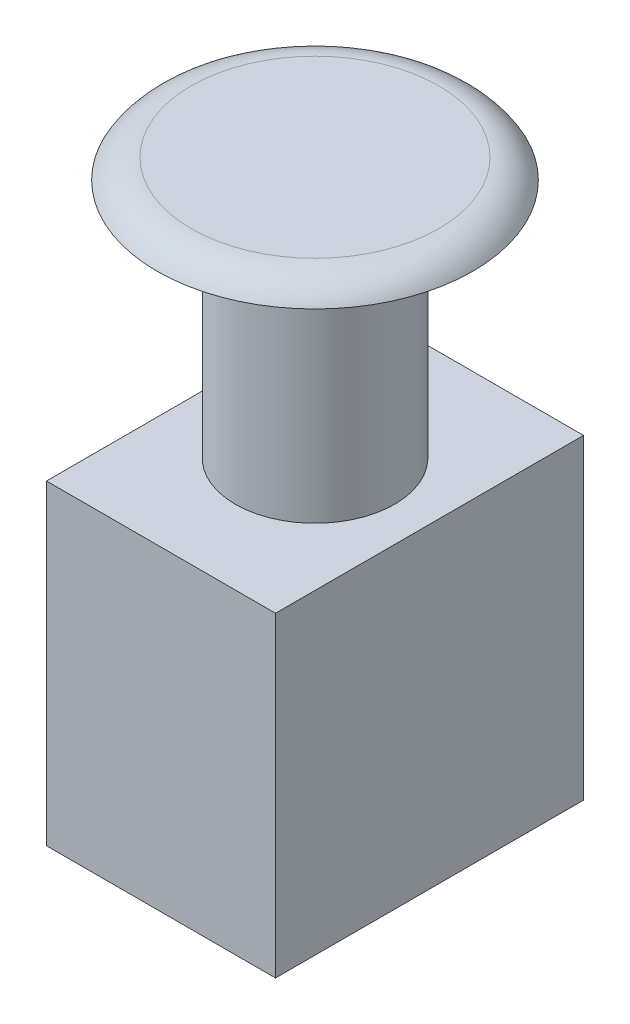
ISO-10303-21;
HEADER;
FILE_DESCRIPTION(('STEP AP214'),'2;1');
FILE_NAME('part.step','',(''),(''),'','','');
FILE_SCHEMA(('AUTOMOTIVE_DESIGN { 1 0 10303 214 1 1 1 1 }'));
ENDSEC;
DATA;
#1=APPLICATION_CONTEXT('core data for automotive mechanical design processes');
#2=APPLICATION_PROTOCOL_DEFINITION('international standard','automotive_design',2000,#1);
#3=PRODUCT_CONTEXT('',#1,'mechanical');
#4=PRODUCT('Part','Part','',(#3));
#5=PRODUCT_RELATED_PRODUCT_CATEGORY('part','',(#4));
#6=PRODUCT_DEFINITION_FORMATION('','',#4);
#7=PRODUCT_DEFINITION_CONTEXT('part definition',#1,'design');
#8=PRODUCT_DEFINITION('design','',#6,#7);
#9=PRODUCT_DEFINITION_SHAPE('','',#8);
#10=(LENGTH_UNIT() NAMED_UNIT(*) SI_UNIT(.MILLI.,.METRE.));
#11=(NAMED_UNIT(*) PLANE_ANGLE_UNIT() SI_UNIT($,.RADIAN.));
#12=(NAMED_UNIT(*) SI_UNIT($,.STERADIAN.) SOLID_ANGLE_UNIT());
#13=UNCERTAINTY_MEASURE_WITH_UNIT(LENGTH_MEASURE(1.E-05),#10,'distance_accuracy_value','');
#14=(GEOMETRIC_REPRESENTATION_CONTEXT(3) GLOBAL_UNCERTAINTY_ASSIGNED_CONTEXT((#13)) GLOBAL_UNIT_ASSIGNED_CONTEXT((#10,
#11,#12)) REPRESENTATION_CONTEXT('',''));
#15=CARTESIAN_POINT('',(0.,0.,0.));
#16=DIRECTION('',(0.,0.,1.));
#17=DIRECTION('',(1.,0.,0.));
#18=AXIS2_PLACEMENT_3D('',#15,#16,#17);
#19=CARTESIAN_POINT('',(0.,73.,0.));
#20=DIRECTION('',(0.,-1.,0.));
#21=DIRECTION('',(0.,0.,-1.));
#22=AXIS2_PLACEMENT_3D('',#19,#20,#21);
#23=CYLINDRICAL_SURFACE('',#22,10.1);
#24=CARTESIAN_POINT('',(0.,40.,0.));
#25=DIRECTION('',(0.,1.,0.));
#26=DIRECTION('',(0.,0.,1.));
#27=AXIS2_PLACEMENT_3D('',#24,#25,#26);
#28=CIRCLE('',#27,10.1);
#29=CARTESIAN_POINT('',(0.,40.,10.1));
#30=VERTEX_POINT('',#29);
#31=EDGE_CURVE('E131',#30,#30,#28,.T.);
#32=ORIENTED_EDGE('',*,*,#31,.T.);
#33=EDGE_LOOP('',(#32));
#34=FACE_BOUND('',#33,.T.);
#35=CARTESIAN_POINT('',(0.,70.5,0.));
#36=DIRECTION('',(0.,1.,0.));
#37=DIRECTION('',(0.,0.,1.));
#38=AXIS2_PLACEMENT_3D('',#35,#36,#37);
#39=CIRCLE('',#38,10.1);
#40=CARTESIAN_POINT('',(0.,70.5,10.1));
#41=VERTEX_POINT('',#40);
#42=EDGE_CURVE('E51',#41,#41,#39,.T.);
#43=ORIENTED_EDGE('',*,*,#42,.F.);
#44=EDGE_LOOP('',(#43));
#45=FACE_BOUND('',#44,.T.);
#46=ADVANCED_FACE('F41',(#34,#45),#23,.T.);
#47=CARTESIAN_POINT('',(-14.5,40.,-19.5));
#48=DIRECTION('',(0.,0.,-1.));
#49=DIRECTION('',(-1.,0.,0.));
#50=AXIS2_PLACEMENT_3D('',#47,#48,#49);
#51=PLANE('',#50);
#52=DIRECTION('',(1.,0.,0.));
#53=VECTOR('',#52,1.);
#54=CARTESIAN_POINT('',(-14.5,0.,-19.5));
#55=LINE('',#54,#53);
#56=CARTESIAN_POINT('',(-14.5,0.,-19.5));
#57=VERTEX_POINT('',#56);
#58=CARTESIAN_POINT('',(14.5,0.,-19.5));
#59=VERTEX_POINT('',#58);
#60=EDGE_CURVE('E117',#57,#59,#55,.T.);
#61=ORIENTED_EDGE('',*,*,#60,.F.);
#62=DIRECTION('',(0.,-1.,0.));
#63=VECTOR('',#62,1.);
#64=CARTESIAN_POINT('',(-14.5,40.,-19.5));
#65=LINE('',#64,#63);
#66=CARTESIAN_POINT('',(-14.5,40.,-19.5));
#67=VERTEX_POINT('',#66);
#68=EDGE_CURVE('E59',#67,#57,#65,.T.);
#69=ORIENTED_EDGE('',*,*,#68,.F.);
#70=DIRECTION('',(1.,0.,0.));
#71=VECTOR('',#70,1.);
#72=CARTESIAN_POINT('',(-14.5,40.,-19.5));
#73=LINE('',#72,#71);
#74=CARTESIAN_POINT('',(14.5,40.,-19.5));
#75=VERTEX_POINT('',#74);
#76=EDGE_CURVE('E109',#67,#75,#73,.T.);
#77=ORIENTED_EDGE('',*,*,#76,.T.);
#78=DIRECTION('',(0.,-1.,0.));
#79=VECTOR('',#78,1.);
#80=CARTESIAN_POINT('',(14.5,40.,-19.5));
#81=LINE('',#80,#79);
#82=EDGE_CURVE('E84',#75,#59,#81,.T.);
#83=ORIENTED_EDGE('',*,*,#82,.T.);
#84=EDGE_LOOP('',(#61,#69,#77,#83));
#85=FACE_BOUND('',#84,.T.);
#86=ADVANCED_FACE('F164',(#85),#51,.T.);
#87=CARTESIAN_POINT('',(-14.5,40.,-19.5));
#88=DIRECTION('',(1.,0.,0.));
#89=DIRECTION('',(0.,0.,-1.));
#90=AXIS2_PLACEMENT_3D('',#87,#88,#89);
#91=PLANE('',#90);
#92=DIRECTION('',(0.,0.,1.));
#93=VECTOR('',#92,1.);
#94=CARTESIAN_POINT('',(-14.5,0.,-19.5));
#95=LINE('',#94,#93);
#96=CARTESIAN_POINT('',(-14.5,0.,19.5));
#97=VERTEX_POINT('',#96);
#98=EDGE_CURVE('E76',#57,#97,#95,.T.);
#99=ORIENTED_EDGE('',*,*,#98,.T.);
#100=DIRECTION('',(0.,-1.,0.));
#101=VECTOR('',#100,1.);
#102=CARTESIAN_POINT('',(-14.5,40.,19.5));
#103=LINE('',#102,#101);
#104=CARTESIAN_POINT('',(-14.5,40.,19.5));
#105=VERTEX_POINT('',#104);
#106=EDGE_CURVE('E105',#105,#97,#103,.T.);
#107=ORIENTED_EDGE('',*,*,#106,.F.);
#108=DIRECTION('',(0.,0.,1.));
#109=VECTOR('',#108,1.);
#110=CARTESIAN_POINT('',(-14.5,40.,-19.5));
#111=LINE('',#110,#109);
#112=EDGE_CURVE('E94',#67,#105,#111,.T.);
#113=ORIENTED_EDGE('',*,*,#112,.F.);
#114=ORIENTED_EDGE('',*,*,#68,.T.);
#115=EDGE_LOOP('',(#99,#107,#113,#114));
#116=FACE_BOUND('',#115,.T.);
#117=ADVANCED_FACE('F169',(#116),#91,.F.);
#118=CARTESIAN_POINT('',(-14.5,40.,19.5));
#119=DIRECTION('',(0.,0.,-1.));
#120=DIRECTION('',(-1.,0.,0.));
#121=AXIS2_PLACEMENT_3D('',#118,#119,#120);
#122=PLANE('',#121);
#123=DIRECTION('',(1.,0.,0.));
#124=VECTOR('',#123,1.);
#125=CARTESIAN_POINT('',(-14.5,0.,19.5));
#126=LINE('',#125,#124);
#127=CARTESIAN_POINT('',(14.5,0.,19.5));
#128=VERTEX_POINT('',#127);
#129=EDGE_CURVE('E102',#97,#128,#126,.T.);
#130=ORIENTED_EDGE('',*,*,#129,.T.);
#131=DIRECTION('',(0.,-1.,0.));
#132=VECTOR('',#131,1.);
#133=CARTESIAN_POINT('',(14.5,40.,19.5));
#134=LINE('',#133,#132);
#135=CARTESIAN_POINT('',(14.5,40.,19.5));
#136=VERTEX_POINT('',#135);
#137=EDGE_CURVE('E99',#136,#128,#134,.T.);
#138=ORIENTED_EDGE('',*,*,#137,.F.);
#139=DIRECTION('',(1.,0.,0.));
#140=VECTOR('',#139,1.);
#141=CARTESIAN_POINT('',(-14.5,40.,19.5));
#142=LINE('',#141,#140);
#143=EDGE_CURVE('E89',#105,#136,#142,.T.);
#144=ORIENTED_EDGE('',*,*,#143,.F.);
#145=ORIENTED_EDGE('',*,*,#106,.T.);
#146=EDGE_LOOP('',(#130,#138,#144,#145));
#147=FACE_BOUND('',#146,.T.);
#148=ADVANCED_FACE('F100',(#147),#122,.F.);
#149=CARTESIAN_POINT('',(14.5,40.,-19.5));
#150=DIRECTION('',(1.,0.,0.));
#151=DIRECTION('',(0.,0.,-1.));
#152=AXIS2_PLACEMENT_3D('',#149,#150,#151);
#153=PLANE('',#152);
#154=DIRECTION('',(0.,0.,1.));
#155=VECTOR('',#154,1.);
#156=CARTESIAN_POINT('',(14.5,0.,-19.5));
#157=LINE('',#156,#155);
#158=EDGE_CURVE('E121',#59,#128,#157,.T.);
#159=ORIENTED_EDGE('',*,*,#158,.F.);
#160=ORIENTED_EDGE('',*,*,#82,.F.);
#161=DIRECTION('',(0.,0.,1.));
#162=VECTOR('',#161,1.);
#163=CARTESIAN_POINT('',(14.5,40.,-19.5));
#164=LINE('',#163,#162);
#165=EDGE_CURVE('E93',#75,#136,#164,.T.);
#166=ORIENTED_EDGE('',*,*,#165,.T.);
#167=ORIENTED_EDGE('',*,*,#137,.T.);
#168=EDGE_LOOP('',(#159,#160,#166,#167));
#169=FACE_BOUND('',#168,.T.);
#170=ADVANCED_FACE('F107',(#169),#153,.T.);
#171=CARTESIAN_POINT('',(0.,40.,0.));
#172=DIRECTION('',(0.,-1.,0.));
#173=DIRECTION('',(0.,0.,-1.));
#174=AXIS2_PLACEMENT_3D('',#171,#172,#173);
#175=PLANE('',#174);
#176=ORIENTED_EDGE('',*,*,#31,.F.);
#177=EDGE_LOOP('',(#176));
#178=FACE_BOUND('',#177,.T.);
#179=ORIENTED_EDGE('',*,*,#76,.F.);
#180=ORIENTED_EDGE('',*,*,#112,.T.);
#181=ORIENTED_EDGE('',*,*,#143,.T.);
#182=ORIENTED_EDGE('',*,*,#165,.F.);
#183=EDGE_LOOP('',(#179,#180,#181,#182));
#184=FACE_BOUND('',#183,.T.);
#185=ADVANCED_FACE('F92',(#178,#184),#175,.F.);
#186=CARTESIAN_POINT('',(0.,0.,0.));
#187=DIRECTION('',(0.,-1.,0.));
#188=DIRECTION('',(0.,0.,-1.));
#189=AXIS2_PLACEMENT_3D('',#186,#187,#188);
#190=PLANE('',#189);
#191=ORIENTED_EDGE('',*,*,#60,.T.);
#192=ORIENTED_EDGE('',*,*,#158,.T.);
#193=ORIENTED_EDGE('',*,*,#129,.F.);
#194=ORIENTED_EDGE('',*,*,#98,.F.);
#195=EDGE_LOOP('',(#191,#192,#193,#194));
#196=FACE_BOUND('',#195,.T.);
#197=ADVANCED_FACE('F153',(#196),#190,.T.);
#198=CARTESIAN_POINT('',(0.,70.5,0.));
#199=DIRECTION('',(0.,1.,0.));
#200=DIRECTION('',(0.,0.,1.));
#201=AXIS2_PLACEMENT_3D('',#198,#199,#200);
#202=PLANE('',#201);
#203=ORIENTED_EDGE('',*,*,#42,.T.);
#204=EDGE_LOOP('',(#203));
#205=FACE_BOUND('',#204,.T.);
#206=CARTESIAN_POINT('',(0.,70.5,0.));
#207=DIRECTION('',(0.,1.,0.));
#208=DIRECTION('',(0.,0.,1.));
#209=AXIS2_PLACEMENT_3D('',#206,#207,#208);
#210=CIRCLE('',#209,20.);
#211=CARTESIAN_POINT('',(0.,70.5,20.));
#212=VERTEX_POINT('',#211);
#213=EDGE_CURVE('E122',#212,#212,#210,.T.);
#214=ORIENTED_EDGE('',*,*,#213,.F.);
#215=EDGE_LOOP('',(#214));
#216=FACE_BOUND('',#215,.T.);
#217=ADVANCED_FACE('F150',(#205,#216),#202,.F.);
#218=CARTESIAN_POINT('',(0.,73.,0.));
#219=DIRECTION('',(0.,1.,0.));
#220=DIRECTION('',(0.,0.,1.));
#221=AXIS2_PLACEMENT_3D('',#218,#219,#220);
#222=PLANE('',#221);
#223=CARTESIAN_POINT('',(0.,73.,0.));
#224=DIRECTION('',(0.,1.,0.));
#225=DIRECTION('',(0.,0.,1.));
#226=AXIS2_PLACEMENT_3D('',#223,#224,#225);
#227=CIRCLE('',#226,15.6698729810778);
#228=CARTESIAN_POINT('',(0.,73.,15.6698729810778));
#229=VERTEX_POINT('',#228);
#230=EDGE_CURVE('E11',#229,#229,#227,.T.);
#231=ORIENTED_EDGE('',*,*,#230,.T.);
#232=EDGE_LOOP('',(#231));
#233=FACE_BOUND('',#232,.T.);
#234=ADVANCED_FACE('F152',(#233),#222,.T.);
#235=CARTESIAN_POINT('',(0.,68.,0.));
#236=DIRECTION('',(0.,-1.,0.));
#237=DIRECTION('',(0.,0.,-1.));
#238=AXIS2_PLACEMENT_3D('',#235,#236,#237);
#239=TOROIDAL_SURFACE('',#238,15.6698729810778,5.);
#240=ORIENTED_EDGE('',*,*,#213,.T.);
#241=EDGE_LOOP('',(#240));
#242=FACE_BOUND('',#241,.T.);
#243=ORIENTED_EDGE('',*,*,#230,.F.);
#244=EDGE_LOOP('',(#243));
#245=FACE_BOUND('',#244,.T.);
#246=ADVANCED_FACE('F43',(#242,#245),#239,.T.);
#247=CLOSED_SHELL('',(#46,#86,#117,#148,#170,#185,#197,#217,#234,#246));
#248=MANIFOLD_SOLID_BREP('B2',#247);
#249=ADVANCED_BREP_SHAPE_REPRESENTATION('',(#18,#248),#14);
#250=SHAPE_DEFINITION_REPRESENTATION(#9,#249);
ENDSEC;
END-ISO-10303-21;
